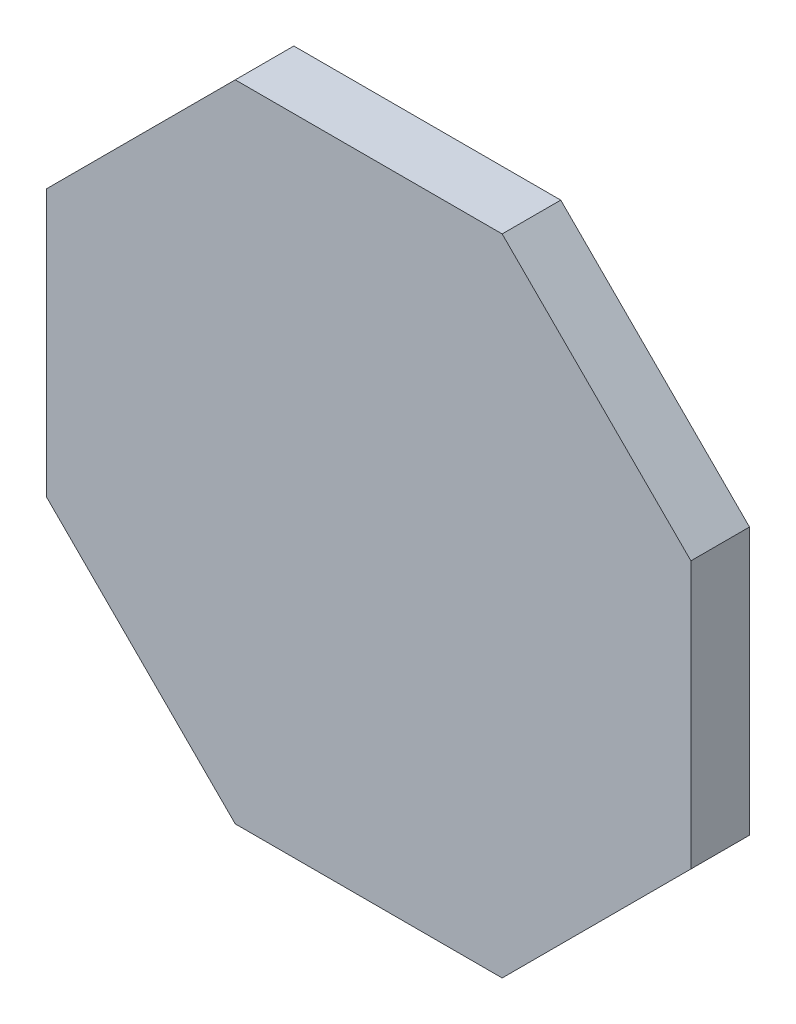
ISO-10303-21;
HEADER;
FILE_DESCRIPTION(('STEP AP214'),'2;1');
FILE_NAME('part.step','',(''),(''),'','','');
FILE_SCHEMA(('AUTOMOTIVE_DESIGN { 1 0 10303 214 1 1 1 1 }'));
ENDSEC;
DATA;
#1=APPLICATION_CONTEXT('core data for automotive mechanical design processes');
#2=APPLICATION_PROTOCOL_DEFINITION('international standard','automotive_design',2000,#1);
#3=PRODUCT_CONTEXT('',#1,'mechanical');
#4=PRODUCT('Part','Part','',(#3));
#5=PRODUCT_RELATED_PRODUCT_CATEGORY('part','',(#4));
#6=PRODUCT_DEFINITION_FORMATION('','',#4);
#7=PRODUCT_DEFINITION_CONTEXT('part definition',#1,'design');
#8=PRODUCT_DEFINITION('design','',#6,#7);
#9=PRODUCT_DEFINITION_SHAPE('','',#8);
#10=(LENGTH_UNIT() NAMED_UNIT(*) SI_UNIT(.MILLI.,.METRE.));
#11=(NAMED_UNIT(*) PLANE_ANGLE_UNIT() SI_UNIT($,.RADIAN.));
#12=(NAMED_UNIT(*) SI_UNIT($,.STERADIAN.) SOLID_ANGLE_UNIT());
#13=UNCERTAINTY_MEASURE_WITH_UNIT(LENGTH_MEASURE(1.E-05),#10,'distance_accuracy_value','');
#14=(GEOMETRIC_REPRESENTATION_CONTEXT(3) GLOBAL_UNCERTAINTY_ASSIGNED_CONTEXT((#13)) GLOBAL_UNIT_ASSIGNED_CONTEXT((#10,
#11,#12)) REPRESENTATION_CONTEXT('',''));
#15=CARTESIAN_POINT('',(0.,0.,0.));
#16=DIRECTION('',(0.,0.,1.));
#17=DIRECTION('',(1.,0.,0.));
#18=AXIS2_PLACEMENT_3D('',#15,#16,#17);
#19=CARTESIAN_POINT('',(54.9999999999999,-22.7817459305202,10.));
#20=DIRECTION('',(-1.,0.,0.));
#21=DIRECTION('',(0.,0.,1.));
#22=AXIS2_PLACEMENT_3D('',#19,#20,#21);
#23=PLANE('',#22);
#24=DIRECTION('',(0.,1.,0.));
#25=VECTOR('',#24,1.);
#26=CARTESIAN_POINT('',(54.9999999999999,-22.7817459305202,0.));
#27=LINE('',#26,#25);
#28=CARTESIAN_POINT('',(54.9999999999999,-22.7817459305202,0.));
#29=VERTEX_POINT('',#28);
#30=CARTESIAN_POINT('',(54.9999999999999,22.7817459305202,0.));
#31=VERTEX_POINT('',#30);
#32=EDGE_CURVE('E135',#29,#31,#27,.T.);
#33=ORIENTED_EDGE('',*,*,#32,.T.);
#34=DIRECTION('',(0.,0.,-1.));
#35=VECTOR('',#34,1.);
#36=CARTESIAN_POINT('',(54.9999999999999,22.7817459305202,10.));
#37=LINE('',#36,#35);
#38=CARTESIAN_POINT('',(54.9999999999999,22.7817459305202,10.));
#39=VERTEX_POINT('',#38);
#40=EDGE_CURVE('E11',#39,#31,#37,.T.);
#41=ORIENTED_EDGE('',*,*,#40,.F.);
#42=DIRECTION('',(0.,1.,0.));
#43=VECTOR('',#42,1.);
#44=CARTESIAN_POINT('',(54.9999999999999,-22.7817459305202,10.));
#45=LINE('',#44,#43);
#46=CARTESIAN_POINT('',(54.9999999999999,-22.7817459305202,10.));
#47=VERTEX_POINT('',#46);
#48=EDGE_CURVE('E149',#47,#39,#45,.T.);
#49=ORIENTED_EDGE('',*,*,#48,.F.);
#50=DIRECTION('',(0.,0.,-1.));
#51=VECTOR('',#50,1.);
#52=CARTESIAN_POINT('',(54.9999999999999,-22.7817459305202,10.));
#53=LINE('',#52,#51);
#54=EDGE_CURVE('E131',#47,#29,#53,.T.);
#55=ORIENTED_EDGE('',*,*,#54,.T.);
#56=EDGE_LOOP('',(#33,#41,#49,#55));
#57=FACE_BOUND('',#56,.T.);
#58=ADVANCED_FACE('F39',(#57),#23,.F.);
#59=CARTESIAN_POINT('',(54.9999999999999,22.7817459305202,10.));
#60=DIRECTION('',(-0.707106781186548,-0.707106781186548,0.));
#61=DIRECTION('',(0.707106781186548,-0.707106781186548,0.));
#62=AXIS2_PLACEMENT_3D('',#59,#60,#61);
#63=PLANE('',#62);
#64=DIRECTION('',(-0.707106781186548,0.707106781186548,0.));
#65=VECTOR('',#64,1.);
#66=CARTESIAN_POINT('',(54.9999999999999,22.7817459305202,0.));
#67=LINE('',#66,#65);
#68=CARTESIAN_POINT('',(22.7817459305202,54.9999999999999,0.));
#69=VERTEX_POINT('',#68);
#70=EDGE_CURVE('E138',#31,#69,#67,.T.);
#71=ORIENTED_EDGE('',*,*,#70,.T.);
#72=DIRECTION('',(0.,0.,-1.));
#73=VECTOR('',#72,1.);
#74=CARTESIAN_POINT('',(22.7817459305202,54.9999999999999,10.));
#75=LINE('',#74,#73);
#76=CARTESIAN_POINT('',(22.7817459305202,54.9999999999999,10.));
#77=VERTEX_POINT('',#76);
#78=EDGE_CURVE('E47',#77,#69,#75,.T.);
#79=ORIENTED_EDGE('',*,*,#78,.F.);
#80=DIRECTION('',(-0.707106781186548,0.707106781186548,0.));
#81=VECTOR('',#80,1.);
#82=CARTESIAN_POINT('',(54.9999999999999,22.7817459305202,10.));
#83=LINE('',#82,#81);
#84=EDGE_CURVE('E98',#39,#77,#83,.T.);
#85=ORIENTED_EDGE('',*,*,#84,.F.);
#86=ORIENTED_EDGE('',*,*,#40,.T.);
#87=EDGE_LOOP('',(#71,#79,#85,#86));
#88=FACE_BOUND('',#87,.T.);
#89=ADVANCED_FACE('F184',(#88),#63,.F.);
#90=CARTESIAN_POINT('',(22.7817459305202,54.9999999999999,10.));
#91=DIRECTION('',(0.,-1.,0.));
#92=DIRECTION('',(1.,0.,0.));
#93=AXIS2_PLACEMENT_3D('',#90,#91,#92);
#94=PLANE('',#93);
#95=DIRECTION('',(-1.,0.,0.));
#96=VECTOR('',#95,1.);
#97=CARTESIAN_POINT('',(22.7817459305202,54.9999999999999,0.));
#98=LINE('',#97,#96);
#99=CARTESIAN_POINT('',(-22.7817459305202,54.9999999999999,0.));
#100=VERTEX_POINT('',#99);
#101=EDGE_CURVE('E140',#69,#100,#98,.T.);
#102=ORIENTED_EDGE('',*,*,#101,.T.);
#103=DIRECTION('',(0.,0.,-1.));
#104=VECTOR('',#103,1.);
#105=CARTESIAN_POINT('',(-22.7817459305202,54.9999999999999,10.));
#106=LINE('',#105,#104);
#107=CARTESIAN_POINT('',(-22.7817459305202,54.9999999999999,10.));
#108=VERTEX_POINT('',#107);
#109=EDGE_CURVE('E156',#108,#100,#106,.T.);
#110=ORIENTED_EDGE('',*,*,#109,.F.);
#111=DIRECTION('',(-1.,0.,0.));
#112=VECTOR('',#111,1.);
#113=CARTESIAN_POINT('',(22.7817459305202,54.9999999999999,10.));
#114=LINE('',#113,#112);
#115=EDGE_CURVE('E164',#77,#108,#114,.T.);
#116=ORIENTED_EDGE('',*,*,#115,.F.);
#117=ORIENTED_EDGE('',*,*,#78,.T.);
#118=EDGE_LOOP('',(#102,#110,#116,#117));
#119=FACE_BOUND('',#118,.T.);
#120=ADVANCED_FACE('F162',(#119),#94,.F.);
#121=CARTESIAN_POINT('',(-22.7817459305202,54.9999999999999,10.));
#122=DIRECTION('',(0.707106781186548,-0.707106781186547,0.));
#123=DIRECTION('',(0.707106781186547,0.707106781186548,0.));
#124=AXIS2_PLACEMENT_3D('',#121,#122,#123);
#125=PLANE('',#124);
#126=DIRECTION('',(-0.707106781186547,-0.707106781186548,0.));
#127=VECTOR('',#126,1.);
#128=CARTESIAN_POINT('',(-22.7817459305202,54.9999999999999,0.));
#129=LINE('',#128,#127);
#130=CARTESIAN_POINT('',(-54.9999999999999,22.7817459305202,0.));
#131=VERTEX_POINT('',#130);
#132=EDGE_CURVE('E142',#100,#131,#129,.T.);
#133=ORIENTED_EDGE('',*,*,#132,.T.);
#134=DIRECTION('',(0.,0.,-1.));
#135=VECTOR('',#134,1.);
#136=CARTESIAN_POINT('',(-54.9999999999999,22.7817459305202,10.));
#137=LINE('',#136,#135);
#138=CARTESIAN_POINT('',(-54.9999999999999,22.7817459305202,10.));
#139=VERTEX_POINT('',#138);
#140=EDGE_CURVE('E153',#139,#131,#137,.T.);
#141=ORIENTED_EDGE('',*,*,#140,.F.);
#142=DIRECTION('',(-0.707106781186547,-0.707106781186548,0.));
#143=VECTOR('',#142,1.);
#144=CARTESIAN_POINT('',(-22.7817459305202,54.9999999999999,10.));
#145=LINE('',#144,#143);
#146=EDGE_CURVE('E176',#108,#139,#145,.T.);
#147=ORIENTED_EDGE('',*,*,#146,.F.);
#148=ORIENTED_EDGE('',*,*,#109,.T.);
#149=EDGE_LOOP('',(#133,#141,#147,#148));
#150=FACE_BOUND('',#149,.T.);
#151=ADVANCED_FACE('F172',(#150),#125,.F.);
#152=CARTESIAN_POINT('',(-54.9999999999999,22.7817459305202,10.));
#153=DIRECTION('',(1.,0.,0.));
#154=DIRECTION('',(0.,1.,0.));
#155=AXIS2_PLACEMENT_3D('',#152,#153,#154);
#156=PLANE('',#155);
#157=DIRECTION('',(0.,-1.,0.));
#158=VECTOR('',#157,1.);
#159=CARTESIAN_POINT('',(-54.9999999999999,22.7817459305202,0.));
#160=LINE('',#159,#158);
#161=CARTESIAN_POINT('',(-54.9999999999999,-22.7817459305202,0.));
#162=VERTEX_POINT('',#161);
#163=EDGE_CURVE('E144',#131,#162,#160,.T.);
#164=ORIENTED_EDGE('',*,*,#163,.T.);
#165=DIRECTION('',(0.,0.,-1.));
#166=VECTOR('',#165,1.);
#167=CARTESIAN_POINT('',(-54.9999999999999,-22.7817459305202,10.));
#168=LINE('',#167,#166);
#169=CARTESIAN_POINT('',(-54.9999999999999,-22.7817459305202,10.));
#170=VERTEX_POINT('',#169);
#171=EDGE_CURVE('E126',#170,#162,#168,.T.);
#172=ORIENTED_EDGE('',*,*,#171,.F.);
#173=DIRECTION('',(0.,-1.,0.));
#174=VECTOR('',#173,1.);
#175=CARTESIAN_POINT('',(-54.9999999999999,22.7817459305202,10.));
#176=LINE('',#175,#174);
#177=EDGE_CURVE('E117',#139,#170,#176,.T.);
#178=ORIENTED_EDGE('',*,*,#177,.F.);
#179=ORIENTED_EDGE('',*,*,#140,.T.);
#180=EDGE_LOOP('',(#164,#172,#178,#179));
#181=FACE_BOUND('',#180,.T.);
#182=ADVANCED_FACE('F175',(#181),#156,.F.);
#183=CARTESIAN_POINT('',(-54.9999999999999,-22.7817459305202,10.));
#184=DIRECTION('',(0.707106781186548,0.707106781186548,0.));
#185=DIRECTION('',(-0.707106781186548,0.707106781186548,0.));
#186=AXIS2_PLACEMENT_3D('',#183,#184,#185);
#187=PLANE('',#186);
#188=DIRECTION('',(0.707106781186548,-0.707106781186548,0.));
#189=VECTOR('',#188,1.);
#190=CARTESIAN_POINT('',(-54.9999999999999,-22.7817459305202,0.));
#191=LINE('',#190,#189);
#192=CARTESIAN_POINT('',(-22.7817459305202,-54.9999999999999,0.));
#193=VERTEX_POINT('',#192);
#194=EDGE_CURVE('E125',#162,#193,#191,.T.);
#195=ORIENTED_EDGE('',*,*,#194,.T.);
#196=DIRECTION('',(0.,0.,-1.));
#197=VECTOR('',#196,1.);
#198=CARTESIAN_POINT('',(-22.7817459305202,-54.9999999999999,10.));
#199=LINE('',#198,#197);
#200=CARTESIAN_POINT('',(-22.7817459305202,-54.9999999999999,10.));
#201=VERTEX_POINT('',#200);
#202=EDGE_CURVE('E122',#201,#193,#199,.T.);
#203=ORIENTED_EDGE('',*,*,#202,.F.);
#204=DIRECTION('',(0.707106781186548,-0.707106781186548,0.));
#205=VECTOR('',#204,1.);
#206=CARTESIAN_POINT('',(-54.9999999999999,-22.7817459305202,10.));
#207=LINE('',#206,#205);
#208=EDGE_CURVE('E111',#170,#201,#207,.T.);
#209=ORIENTED_EDGE('',*,*,#208,.F.);
#210=ORIENTED_EDGE('',*,*,#171,.T.);
#211=EDGE_LOOP('',(#195,#203,#209,#210));
#212=FACE_BOUND('',#211,.T.);
#213=ADVANCED_FACE('F123',(#212),#187,.F.);
#214=CARTESIAN_POINT('',(-22.7817459305202,-54.9999999999999,10.));
#215=DIRECTION('',(0.,1.,0.));
#216=DIRECTION('',(0.,0.,1.));
#217=AXIS2_PLACEMENT_3D('',#214,#215,#216);
#218=PLANE('',#217);
#219=DIRECTION('',(1.,0.,0.));
#220=VECTOR('',#219,1.);
#221=CARTESIAN_POINT('',(-22.7817459305202,-54.9999999999999,0.));
#222=LINE('',#221,#220);
#223=CARTESIAN_POINT('',(22.7817459305202,-54.9999999999999,0.));
#224=VERTEX_POINT('',#223);
#225=EDGE_CURVE('E84',#193,#224,#222,.T.);
#226=ORIENTED_EDGE('',*,*,#225,.T.);
#227=DIRECTION('',(0.,0.,-1.));
#228=VECTOR('',#227,1.);
#229=CARTESIAN_POINT('',(22.7817459305202,-54.9999999999999,10.));
#230=LINE('',#229,#228);
#231=CARTESIAN_POINT('',(22.7817459305202,-54.9999999999999,10.));
#232=VERTEX_POINT('',#231);
#233=EDGE_CURVE('E127',#232,#224,#230,.T.);
#234=ORIENTED_EDGE('',*,*,#233,.F.);
#235=DIRECTION('',(1.,0.,0.));
#236=VECTOR('',#235,1.);
#237=CARTESIAN_POINT('',(-22.7817459305202,-54.9999999999999,10.));
#238=LINE('',#237,#236);
#239=EDGE_CURVE('E115',#201,#232,#238,.T.);
#240=ORIENTED_EDGE('',*,*,#239,.F.);
#241=ORIENTED_EDGE('',*,*,#202,.T.);
#242=EDGE_LOOP('',(#226,#234,#240,#241));
#243=FACE_BOUND('',#242,.T.);
#244=ADVANCED_FACE('F129',(#243),#218,.F.);
#245=CARTESIAN_POINT('',(22.7817459305202,-54.9999999999999,10.));
#246=DIRECTION('',(-0.707106781186548,0.707106781186548,0.));
#247=DIRECTION('',(-0.707106781186548,-0.707106781186548,0.));
#248=AXIS2_PLACEMENT_3D('',#245,#246,#247);
#249=PLANE('',#248);
#250=DIRECTION('',(0.707106781186547,0.707106781186547,0.));
#251=VECTOR('',#250,1.);
#252=CARTESIAN_POINT('',(22.7817459305202,-54.9999999999999,0.));
#253=LINE('',#252,#251);
#254=EDGE_CURVE('E90',#224,#29,#253,.T.);
#255=ORIENTED_EDGE('',*,*,#254,.T.);
#256=ORIENTED_EDGE('',*,*,#54,.F.);
#257=DIRECTION('',(0.707106781186547,0.707106781186547,0.));
#258=VECTOR('',#257,1.);
#259=CARTESIAN_POINT('',(22.7817459305202,-54.9999999999999,10.));
#260=LINE('',#259,#258);
#261=EDGE_CURVE('E55',#232,#47,#260,.T.);
#262=ORIENTED_EDGE('',*,*,#261,.F.);
#263=ORIENTED_EDGE('',*,*,#233,.T.);
#264=EDGE_LOOP('',(#255,#256,#262,#263));
#265=FACE_BOUND('',#264,.T.);
#266=ADVANCED_FACE('F200',(#265),#249,.F.);
#267=CARTESIAN_POINT('',(0.,0.,10.));
#268=DIRECTION('',(0.,0.,1.));
#269=DIRECTION('',(1.,0.,0.));
#270=AXIS2_PLACEMENT_3D('',#267,#268,#269);
#271=PLANE('',#270);
#272=ORIENTED_EDGE('',*,*,#48,.T.);
#273=ORIENTED_EDGE('',*,*,#84,.T.);
#274=ORIENTED_EDGE('',*,*,#115,.T.);
#275=ORIENTED_EDGE('',*,*,#146,.T.);
#276=ORIENTED_EDGE('',*,*,#177,.T.);
#277=ORIENTED_EDGE('',*,*,#208,.T.);
#278=ORIENTED_EDGE('',*,*,#239,.T.);
#279=ORIENTED_EDGE('',*,*,#261,.T.);
#280=EDGE_LOOP('',(#272,#273,#274,#275,#276,#277,#278,#279));
#281=FACE_BOUND('',#280,.T.);
#282=ADVANCED_FACE('F113',(#281),#271,.T.);
#283=CARTESIAN_POINT('',(0.,0.,0.));
#284=DIRECTION('',(0.,0.,1.));
#285=DIRECTION('',(1.,0.,0.));
#286=AXIS2_PLACEMENT_3D('',#283,#284,#285);
#287=PLANE('',#286);
#288=ORIENTED_EDGE('',*,*,#32,.F.);
#289=ORIENTED_EDGE('',*,*,#254,.F.);
#290=ORIENTED_EDGE('',*,*,#225,.F.);
#291=ORIENTED_EDGE('',*,*,#194,.F.);
#292=ORIENTED_EDGE('',*,*,#163,.F.);
#293=ORIENTED_EDGE('',*,*,#132,.F.);
#294=ORIENTED_EDGE('',*,*,#101,.F.);
#295=ORIENTED_EDGE('',*,*,#70,.F.);
#296=EDGE_LOOP('',(#288,#289,#290,#291,#292,#293,#294,#295));
#297=FACE_BOUND('',#296,.T.);
#298=ADVANCED_FACE('F168',(#297),#287,.F.);
#299=CLOSED_SHELL('',(#58,#89,#120,#151,#182,#213,#244,#266,#282,#298));
#300=MANIFOLD_SOLID_BREP('B2',#299);
#301=ADVANCED_BREP_SHAPE_REPRESENTATION('',(#18,#300),#14);
#302=SHAPE_DEFINITION_REPRESENTATION(#9,#301);
ENDSEC;
END-ISO-10303-21;
